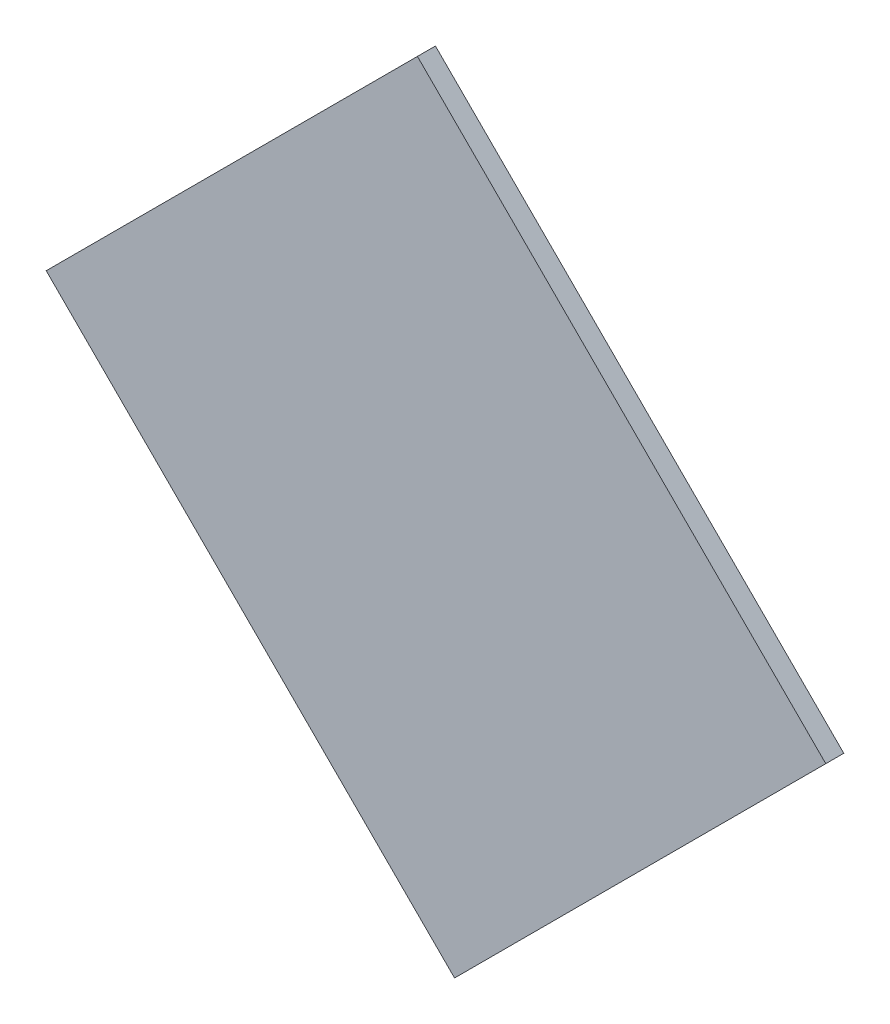
ISO-10303-21;
HEADER;
FILE_DESCRIPTION(('STEP AP214'),'2;1');
FILE_NAME('part.step','',(''),(''),'','','');
FILE_SCHEMA(('AUTOMOTIVE_DESIGN { 1 0 10303 214 1 1 1 1 }'));
ENDSEC;
DATA;
#1=APPLICATION_CONTEXT('core data for automotive mechanical design processes');
#2=APPLICATION_PROTOCOL_DEFINITION('international standard','automotive_design',2000,#1);
#3=PRODUCT_CONTEXT('',#1,'mechanical');
#4=PRODUCT('Part','Part','',(#3));
#5=PRODUCT_RELATED_PRODUCT_CATEGORY('part','',(#4));
#6=PRODUCT_DEFINITION_FORMATION('','',#4);
#7=PRODUCT_DEFINITION_CONTEXT('part definition',#1,'design');
#8=PRODUCT_DEFINITION('design','',#6,#7);
#9=PRODUCT_DEFINITION_SHAPE('','',#8);
#10=(LENGTH_UNIT() NAMED_UNIT(*) SI_UNIT(.MILLI.,.METRE.));
#11=(NAMED_UNIT(*) PLANE_ANGLE_UNIT() SI_UNIT($,.RADIAN.));
#12=(NAMED_UNIT(*) SI_UNIT($,.STERADIAN.) SOLID_ANGLE_UNIT());
#13=UNCERTAINTY_MEASURE_WITH_UNIT(LENGTH_MEASURE(1.E-05),#10,'distance_accuracy_value','');
#14=(GEOMETRIC_REPRESENTATION_CONTEXT(3) GLOBAL_UNCERTAINTY_ASSIGNED_CONTEXT((#13)) GLOBAL_UNIT_ASSIGNED_CONTEXT((#10,
#11,#12)) REPRESENTATION_CONTEXT('',''));
#15=CARTESIAN_POINT('',(0.,0.,0.));
#16=DIRECTION('',(0.,0.,1.));
#17=DIRECTION('',(1.,0.,0.));
#18=AXIS2_PLACEMENT_3D('',#15,#16,#17);
#19=CARTESIAN_POINT('',(11.066726,7.822264,0.76487));
#20=DIRECTION('',(0.,0.,-1.));
#21=DIRECTION('',(-1.,0.,0.));
#22=AXIS2_PLACEMENT_3D('',#19,#20,#21);
#23=PLANE('',#22);
#24=DIRECTION('',(0.707106781186548,0.707106781186548,0.));
#25=VECTOR('',#24,1.);
#26=CARTESIAN_POINT('',(10.324264,7.857619333,0.76487));
#27=LINE('',#26,#25);
#28=CARTESIAN_POINT('',(10.324264,7.857619333,0.76487));
#29=VERTEX_POINT('',#28);
#30=CARTESIAN_POINT('',(11.031370667,8.564726,0.76487));
#31=VERTEX_POINT('',#30);
#32=EDGE_CURVE('E55',#29,#31,#27,.T.);
#33=ORIENTED_EDGE('',*,*,#32,.T.);
#34=DIRECTION('',(0.707106781186548,-0.707106781186548,0.));
#35=VECTOR('',#34,1.);
#36=CARTESIAN_POINT('',(11.031370667,8.564726,0.76487));
#37=LINE('',#36,#35);
#38=CARTESIAN_POINT('',(11.809188,7.786908667,0.76487));
#39=VERTEX_POINT('',#38);
#40=EDGE_CURVE('E57',#31,#39,#37,.T.);
#41=ORIENTED_EDGE('',*,*,#40,.T.);
#42=DIRECTION('',(-0.707106781186548,-0.707106781186548,0.));
#43=VECTOR('',#42,1.);
#44=CARTESIAN_POINT('',(11.809188,7.786908667,0.76487));
#45=LINE('',#44,#43);
#46=CARTESIAN_POINT('',(11.102081333,7.079802,0.76487));
#47=VERTEX_POINT('',#46);
#48=EDGE_CURVE('E20',#39,#47,#45,.T.);
#49=ORIENTED_EDGE('',*,*,#48,.T.);
#50=DIRECTION('',(-0.707106781186548,0.707106781186548,0.));
#51=VECTOR('',#50,1.);
#52=CARTESIAN_POINT('',(11.102081333,7.079802,0.76487));
#53=LINE('',#52,#51);
#54=EDGE_CURVE('E80',#47,#29,#53,.T.);
#55=ORIENTED_EDGE('',*,*,#54,.T.);
#56=EDGE_LOOP('',(#33,#41,#49,#55));
#57=FACE_BOUND('',#56,.T.);
#58=ADVANCED_FACE('F17',(#57),#23,.T.);
#59=CARTESIAN_POINT('',(11.809188,7.786908667,0.76487));
#60=DIRECTION('',(-0.707106781186548,0.707106781186548,0.));
#61=DIRECTION('',(-0.707106781186548,-0.707106781186548,0.));
#62=AXIS2_PLACEMENT_3D('',#59,#60,#61);
#63=PLANE('',#62);
#64=DIRECTION('',(0.,0.,1.));
#65=VECTOR('',#64,1.);
#66=CARTESIAN_POINT('',(11.102081333,7.079802,0.76487));
#67=LINE('',#66,#65);
#68=CARTESIAN_POINT('',(11.102081333,7.079802,0.79916));
#69=VERTEX_POINT('',#68);
#70=EDGE_CURVE('E68',#69,#47,#67,.F.);
#71=ORIENTED_EDGE('',*,*,#70,.T.);
#72=ORIENTED_EDGE('',*,*,#48,.F.);
#73=DIRECTION('',(0.,0.,1.));
#74=VECTOR('',#73,1.);
#75=CARTESIAN_POINT('',(11.809188,7.786908667,0.76487));
#76=LINE('',#75,#74);
#77=CARTESIAN_POINT('',(11.809188,7.786908667,0.79916));
#78=VERTEX_POINT('',#77);
#79=EDGE_CURVE('E63',#39,#78,#76,.T.);
#80=ORIENTED_EDGE('',*,*,#79,.T.);
#81=DIRECTION('',(0.707106781186549,0.707106781186546,0.));
#82=VECTOR('',#81,1.);
#83=CARTESIAN_POINT('',(11.102081333,7.079802,0.79916));
#84=LINE('',#83,#82);
#85=EDGE_CURVE('E83',#69,#78,#84,.T.);
#86=ORIENTED_EDGE('',*,*,#85,.F.);
#87=EDGE_LOOP('',(#71,#72,#80,#86));
#88=FACE_BOUND('',#87,.T.);
#89=ADVANCED_FACE('F65',(#88),#63,.F.);
#90=CARTESIAN_POINT('',(11.031370667,8.564726,0.76487));
#91=DIRECTION('',(-0.707106781186548,-0.707106781186548,0.));
#92=DIRECTION('',(0.707106781186548,-0.707106781186548,0.));
#93=AXIS2_PLACEMENT_3D('',#90,#91,#92);
#94=PLANE('',#93);
#95=ORIENTED_EDGE('',*,*,#79,.F.);
#96=ORIENTED_EDGE('',*,*,#40,.F.);
#97=DIRECTION('',(0.,0.,1.));
#98=VECTOR('',#97,1.);
#99=CARTESIAN_POINT('',(11.031370667,8.564726,0.76487));
#100=LINE('',#99,#98);
#101=CARTESIAN_POINT('',(11.031370667,8.564726,0.79916));
#102=VERTEX_POINT('',#101);
#103=EDGE_CURVE('E75',#31,#102,#100,.T.);
#104=ORIENTED_EDGE('',*,*,#103,.T.);
#105=DIRECTION('',(-0.707106781186549,0.707106781186546,0.));
#106=VECTOR('',#105,1.);
#107=CARTESIAN_POINT('',(11.809188,7.786908667,0.79916));
#108=LINE('',#107,#106);
#109=EDGE_CURVE('E72',#78,#102,#108,.T.);
#110=ORIENTED_EDGE('',*,*,#109,.F.);
#111=EDGE_LOOP('',(#95,#96,#104,#110));
#112=FACE_BOUND('',#111,.T.);
#113=ADVANCED_FACE('F70',(#112),#94,.F.);
#114=CARTESIAN_POINT('',(10.324264,7.857619333,0.76487));
#115=DIRECTION('',(0.707106781186548,-0.707106781186548,0.));
#116=DIRECTION('',(0.707106781186548,0.707106781186548,0.));
#117=AXIS2_PLACEMENT_3D('',#114,#115,#116);
#118=PLANE('',#117);
#119=ORIENTED_EDGE('',*,*,#103,.F.);
#120=ORIENTED_EDGE('',*,*,#32,.F.);
#121=DIRECTION('',(0.,0.,1.));
#122=VECTOR('',#121,1.);
#123=CARTESIAN_POINT('',(10.324264,7.857619333,0.76487));
#124=LINE('',#123,#122);
#125=CARTESIAN_POINT('',(10.324264,7.857619333,0.79916));
#126=VERTEX_POINT('',#125);
#127=EDGE_CURVE('E35',#29,#126,#124,.T.);
#128=ORIENTED_EDGE('',*,*,#127,.T.);
#129=DIRECTION('',(-0.707106781186547,-0.707106781186547,0.));
#130=VECTOR('',#129,1.);
#131=CARTESIAN_POINT('',(11.031370667,8.564726,0.79916));
#132=LINE('',#131,#130);
#133=EDGE_CURVE('E26',#102,#126,#132,.T.);
#134=ORIENTED_EDGE('',*,*,#133,.F.);
#135=EDGE_LOOP('',(#119,#120,#128,#134));
#136=FACE_BOUND('',#135,.T.);
#137=ADVANCED_FACE('F89',(#136),#118,.F.);
#138=CARTESIAN_POINT('',(11.102081333,7.079802,0.76487));
#139=DIRECTION('',(0.707106781186548,0.707106781186548,0.));
#140=DIRECTION('',(-0.707106781186548,0.707106781186548,0.));
#141=AXIS2_PLACEMENT_3D('',#138,#139,#140);
#142=PLANE('',#141);
#143=ORIENTED_EDGE('',*,*,#127,.F.);
#144=ORIENTED_EDGE('',*,*,#54,.F.);
#145=ORIENTED_EDGE('',*,*,#70,.F.);
#146=DIRECTION('',(0.707106781186547,-0.707106781186548,0.));
#147=VECTOR('',#146,1.);
#148=CARTESIAN_POINT('',(10.324264,7.857619333,0.79916));
#149=LINE('',#148,#147);
#150=EDGE_CURVE('E11',#126,#69,#149,.T.);
#151=ORIENTED_EDGE('',*,*,#150,.F.);
#152=EDGE_LOOP('',(#143,#144,#145,#151));
#153=FACE_BOUND('',#152,.T.);
#154=ADVANCED_FACE('F91',(#153),#142,.F.);
#155=CARTESIAN_POINT('',(11.066726,7.822264,0.79916));
#156=DIRECTION('',(0.,0.,1.));
#157=DIRECTION('',(0.,-1.,0.));
#158=AXIS2_PLACEMENT_3D('',#155,#156,#157);
#159=PLANE('',#158);
#160=ORIENTED_EDGE('',*,*,#133,.T.);
#161=ORIENTED_EDGE('',*,*,#150,.T.);
#162=ORIENTED_EDGE('',*,*,#85,.T.);
#163=ORIENTED_EDGE('',*,*,#109,.T.);
#164=EDGE_LOOP('',(#160,#161,#162,#163));
#165=FACE_BOUND('',#164,.T.);
#166=ADVANCED_FACE('F88',(#165),#159,.T.);
#167=CLOSED_SHELL('',(#58,#89,#113,#137,#154,#166));
#168=MANIFOLD_SOLID_BREP('B1',#167);
#169=ADVANCED_BREP_SHAPE_REPRESENTATION('',(#18,#168),#14);
#170=SHAPE_DEFINITION_REPRESENTATION(#9,#169);
ENDSEC;
END-ISO-10303-21;
